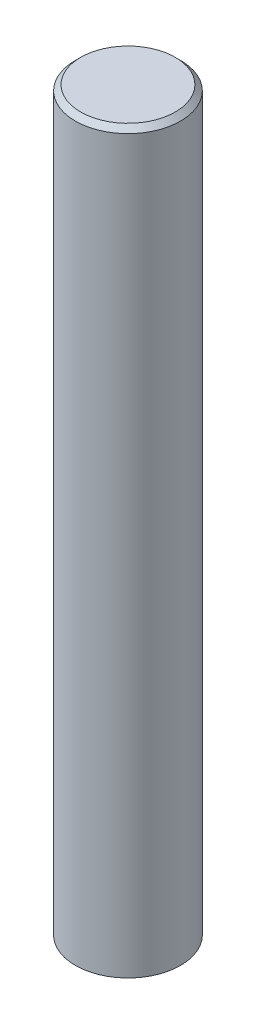
ISO-10303-21;
HEADER;
FILE_DESCRIPTION(('STEP AP214'),'2;1');
FILE_NAME('part.step','',(''),(''),'','','');
FILE_SCHEMA(('AUTOMOTIVE_DESIGN { 1 0 10303 214 1 1 1 1 }'));
ENDSEC;
DATA;
#1=APPLICATION_CONTEXT('core data for automotive mechanical design processes');
#2=APPLICATION_PROTOCOL_DEFINITION('international standard','automotive_design',2000,#1);
#3=PRODUCT_CONTEXT('',#1,'mechanical');
#4=PRODUCT('Part','Part','',(#3));
#5=PRODUCT_RELATED_PRODUCT_CATEGORY('part','',(#4));
#6=PRODUCT_DEFINITION_FORMATION('','',#4);
#7=PRODUCT_DEFINITION_CONTEXT('part definition',#1,'design');
#8=PRODUCT_DEFINITION('design','',#6,#7);
#9=PRODUCT_DEFINITION_SHAPE('','',#8);
#10=(LENGTH_UNIT() NAMED_UNIT(*) SI_UNIT(.MILLI.,.METRE.));
#11=(NAMED_UNIT(*) PLANE_ANGLE_UNIT() SI_UNIT($,.RADIAN.));
#12=(NAMED_UNIT(*) SI_UNIT($,.STERADIAN.) SOLID_ANGLE_UNIT());
#13=UNCERTAINTY_MEASURE_WITH_UNIT(LENGTH_MEASURE(1.E-05),#10,'distance_accuracy_value','');
#14=(GEOMETRIC_REPRESENTATION_CONTEXT(3) GLOBAL_UNCERTAINTY_ASSIGNED_CONTEXT((#13)) GLOBAL_UNIT_ASSIGNED_CONTEXT((#10,
#11,#12)) REPRESENTATION_CONTEXT('',''));
#15=CARTESIAN_POINT('',(0.,0.,0.));
#16=DIRECTION('',(0.,0.,1.));
#17=DIRECTION('',(1.,0.,0.));
#18=AXIS2_PLACEMENT_3D('',#15,#16,#17);
#19=CARTESIAN_POINT('',(0.,140.,0.));
#20=DIRECTION('',(0.,-1.,0.));
#21=DIRECTION('',(0.,0.,-1.));
#22=AXIS2_PLACEMENT_3D('',#19,#20,#21);
#23=CYLINDRICAL_SURFACE('',#22,10.);
#24=CARTESIAN_POINT('',(0.,139.,0.));
#25=DIRECTION('',(0.,1.,0.));
#26=DIRECTION('',(0.,0.,1.));
#27=AXIS2_PLACEMENT_3D('',#24,#25,#26);
#28=CIRCLE('',#27,10.);
#29=CARTESIAN_POINT('',(0.,139.,10.));
#30=VERTEX_POINT('',#29);
#31=EDGE_CURVE('E10',#30,#30,#28,.F.);
#32=ORIENTED_EDGE('',*,*,#31,.T.);
#33=EDGE_LOOP('',(#32));
#34=FACE_BOUND('',#33,.T.);
#35=CARTESIAN_POINT('',(0.,0.,0.));
#36=DIRECTION('',(0.,1.,0.));
#37=DIRECTION('',(0.,0.,1.));
#38=AXIS2_PLACEMENT_3D('',#35,#36,#37);
#39=CIRCLE('',#38,10.);
#40=CARTESIAN_POINT('',(0.,0.,10.));
#41=VERTEX_POINT('',#40);
#42=EDGE_CURVE('E42',#41,#41,#39,.T.);
#43=ORIENTED_EDGE('',*,*,#42,.T.);
#44=EDGE_LOOP('',(#43));
#45=FACE_BOUND('',#44,.T.);
#46=ADVANCED_FACE('F31',(#34,#45),#23,.T.);
#47=CARTESIAN_POINT('',(0.,140.,0.));
#48=DIRECTION('',(0.,1.,0.));
#49=DIRECTION('',(0.,0.,1.));
#50=AXIS2_PLACEMENT_3D('',#47,#48,#49);
#51=PLANE('',#50);
#52=CARTESIAN_POINT('',(0.,140.,0.));
#53=DIRECTION('',(0.,1.,0.));
#54=DIRECTION('',(0.,0.,1.));
#55=AXIS2_PLACEMENT_3D('',#52,#53,#54);
#56=CIRCLE('',#55,8.99999999999998);
#57=CARTESIAN_POINT('',(0.,140.,8.99999999999998));
#58=VERTEX_POINT('',#57);
#59=EDGE_CURVE('E38',#58,#58,#56,.T.);
#60=ORIENTED_EDGE('',*,*,#59,.T.);
#61=EDGE_LOOP('',(#60));
#62=FACE_BOUND('',#61,.T.);
#63=ADVANCED_FACE('F52',(#62),#51,.T.);
#64=CARTESIAN_POINT('',(0.,0.,0.));
#65=DIRECTION('',(0.,1.,0.));
#66=DIRECTION('',(0.,0.,1.));
#67=AXIS2_PLACEMENT_3D('',#64,#65,#66);
#68=PLANE('',#67);
#69=ORIENTED_EDGE('',*,*,#42,.F.);
#70=EDGE_LOOP('',(#69));
#71=FACE_BOUND('',#70,.T.);
#72=ADVANCED_FACE('F50',(#71),#68,.F.);
#73=CARTESIAN_POINT('',(0.,140.,0.));
#74=DIRECTION('',(0.,-1.,0.));
#75=DIRECTION('',(0.,0.,-1.));
#76=AXIS2_PLACEMENT_3D('',#73,#74,#75);
#77=CONICAL_SURFACE('',#76,8.99999999999998,0.785398163397443);
#78=ORIENTED_EDGE('',*,*,#31,.F.);
#79=EDGE_LOOP('',(#78));
#80=FACE_BOUND('',#79,.T.);
#81=ORIENTED_EDGE('',*,*,#59,.F.);
#82=EDGE_LOOP('',(#81));
#83=FACE_BOUND('',#82,.T.);
#84=ADVANCED_FACE('F33',(#80,#83),#77,.T.);
#85=CLOSED_SHELL('',(#46,#63,#72,#84));
#86=MANIFOLD_SOLID_BREP('B2',#85);
#87=ADVANCED_BREP_SHAPE_REPRESENTATION('',(#18,#86),#14);
#88=SHAPE_DEFINITION_REPRESENTATION(#9,#87);
ENDSEC;
END-ISO-10303-21;
